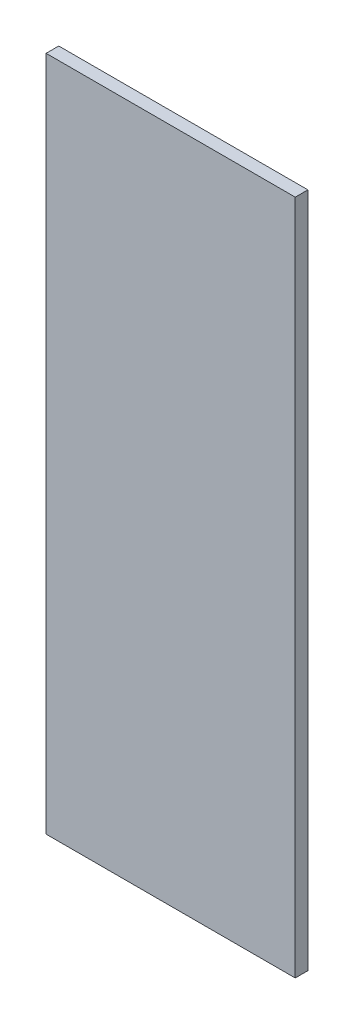
ISO-10303-21;
HEADER;
FILE_DESCRIPTION(('STEP AP214'),'2;1');
FILE_NAME('part.step','',(''),(''),'','','');
FILE_SCHEMA(('AUTOMOTIVE_DESIGN { 1 0 10303 214 1 1 1 1 }'));
ENDSEC;
DATA;
#1=APPLICATION_CONTEXT('core data for automotive mechanical design processes');
#2=APPLICATION_PROTOCOL_DEFINITION('international standard','automotive_design',2000,#1);
#3=PRODUCT_CONTEXT('',#1,'mechanical');
#4=PRODUCT('Part','Part','',(#3));
#5=PRODUCT_RELATED_PRODUCT_CATEGORY('part','',(#4));
#6=PRODUCT_DEFINITION_FORMATION('','',#4);
#7=PRODUCT_DEFINITION_CONTEXT('part definition',#1,'design');
#8=PRODUCT_DEFINITION('design','',#6,#7);
#9=PRODUCT_DEFINITION_SHAPE('','',#8);
#10=(LENGTH_UNIT() NAMED_UNIT(*) SI_UNIT(.MILLI.,.METRE.));
#11=(NAMED_UNIT(*) PLANE_ANGLE_UNIT() SI_UNIT($,.RADIAN.));
#12=(NAMED_UNIT(*) SI_UNIT($,.STERADIAN.) SOLID_ANGLE_UNIT());
#13=UNCERTAINTY_MEASURE_WITH_UNIT(LENGTH_MEASURE(1.E-05),#10,'distance_accuracy_value','');
#14=(GEOMETRIC_REPRESENTATION_CONTEXT(3) GLOBAL_UNCERTAINTY_ASSIGNED_CONTEXT((#13)) GLOBAL_UNIT_ASSIGNED_CONTEXT((#10,
#11,#12)) REPRESENTATION_CONTEXT('',''));
#15=CARTESIAN_POINT('',(0.,0.,0.));
#16=DIRECTION('',(0.,0.,1.));
#17=DIRECTION('',(1.,0.,0.));
#18=AXIS2_PLACEMENT_3D('',#15,#16,#17);
#19=CARTESIAN_POINT('',(85.4420013427734,76.5279998779297,0.));
#20=DIRECTION('',(1.,0.,0.));
#21=DIRECTION('',(0.,-1.,0.));
#22=AXIS2_PLACEMENT_3D('',#19,#20,#21);
#23=PLANE('',#22);
#24=DIRECTION('',(0.,-1.,0.));
#25=VECTOR('',#24,1.);
#26=CARTESIAN_POINT('',(85.4420013427734,76.5279998779297,0.03556));
#27=LINE('',#26,#25);
#28=CARTESIAN_POINT('',(85.4420013427734,76.5279998779297,0.03556));
#29=VERTEX_POINT('',#28);
#30=CARTESIAN_POINT('',(85.4420013427734,74.6279983520508,0.03556));
#31=VERTEX_POINT('',#30);
#32=EDGE_CURVE('E11',#29,#31,#27,.T.);
#33=ORIENTED_EDGE('',*,*,#32,.F.);
#34=DIRECTION('',(0.,0.,1.));
#35=VECTOR('',#34,1.);
#36=CARTESIAN_POINT('',(85.4420013427734,76.5279998779297,0.));
#37=LINE('',#36,#35);
#38=CARTESIAN_POINT('',(85.4420013427734,76.5279998779297,0.));
#39=VERTEX_POINT('',#38);
#40=EDGE_CURVE('E24',#39,#29,#37,.T.);
#41=ORIENTED_EDGE('',*,*,#40,.F.);
#42=DIRECTION('',(0.,-1.,0.));
#43=VECTOR('',#42,1.);
#44=CARTESIAN_POINT('',(85.4420013427734,76.5279998779297,0.));
#45=LINE('',#44,#43);
#46=CARTESIAN_POINT('',(85.4420013427734,74.6279983520508,0.));
#47=VERTEX_POINT('',#46);
#48=EDGE_CURVE('E75',#39,#47,#45,.T.);
#49=ORIENTED_EDGE('',*,*,#48,.T.);
#50=DIRECTION('',(0.,0.,1.));
#51=VECTOR('',#50,1.);
#52=CARTESIAN_POINT('',(85.4420013427734,74.6279983520508,0.));
#53=LINE('',#52,#51);
#54=EDGE_CURVE('E37',#47,#31,#53,.T.);
#55=ORIENTED_EDGE('',*,*,#54,.T.);
#56=EDGE_LOOP('',(#33,#41,#49,#55));
#57=FACE_BOUND('',#56,.T.);
#58=ADVANCED_FACE('F17',(#57),#23,.F.);
#59=CARTESIAN_POINT('',(85.4420013427734,74.6279983520508,0.));
#60=DIRECTION('',(0.,1.,0.));
#61=DIRECTION('',(1.,0.,0.));
#62=AXIS2_PLACEMENT_3D('',#59,#60,#61);
#63=PLANE('',#62);
#64=DIRECTION('',(1.,0.,0.));
#65=VECTOR('',#64,1.);
#66=CARTESIAN_POINT('',(85.4420013427734,74.6279983520508,0.03556));
#67=LINE('',#66,#65);
#68=CARTESIAN_POINT('',(86.1419982910156,74.6279983520508,0.03556));
#69=VERTEX_POINT('',#68);
#70=EDGE_CURVE('E83',#31,#69,#67,.T.);
#71=ORIENTED_EDGE('',*,*,#70,.F.);
#72=ORIENTED_EDGE('',*,*,#54,.F.);
#73=DIRECTION('',(1.,0.,0.));
#74=VECTOR('',#73,1.);
#75=CARTESIAN_POINT('',(85.4420013427734,74.6279983520508,0.));
#76=LINE('',#75,#74);
#77=CARTESIAN_POINT('',(86.1419982910156,74.6279983520508,0.));
#78=VERTEX_POINT('',#77);
#79=EDGE_CURVE('E81',#47,#78,#76,.T.);
#80=ORIENTED_EDGE('',*,*,#79,.T.);
#81=DIRECTION('',(0.,0.,1.));
#82=VECTOR('',#81,1.);
#83=CARTESIAN_POINT('',(86.1419982910156,74.6279983520508,0.));
#84=LINE('',#83,#82);
#85=EDGE_CURVE('E67',#78,#69,#84,.T.);
#86=ORIENTED_EDGE('',*,*,#85,.T.);
#87=EDGE_LOOP('',(#71,#72,#80,#86));
#88=FACE_BOUND('',#87,.T.);
#89=ADVANCED_FACE('F89',(#88),#63,.F.);
#90=CARTESIAN_POINT('',(86.1419982910156,74.6279983520508,0.));
#91=DIRECTION('',(-1.,0.,0.));
#92=DIRECTION('',(0.,1.,0.));
#93=AXIS2_PLACEMENT_3D('',#90,#91,#92);
#94=PLANE('',#93);
#95=DIRECTION('',(0.,1.,0.));
#96=VECTOR('',#95,1.);
#97=CARTESIAN_POINT('',(86.1419982910156,74.6279983520508,0.03556));
#98=LINE('',#97,#96);
#99=CARTESIAN_POINT('',(86.1419982910156,76.5279998779297,0.03556));
#100=VERTEX_POINT('',#99);
#101=EDGE_CURVE('E71',#69,#100,#98,.T.);
#102=ORIENTED_EDGE('',*,*,#101,.F.);
#103=ORIENTED_EDGE('',*,*,#85,.F.);
#104=DIRECTION('',(0.,1.,0.));
#105=VECTOR('',#104,1.);
#106=CARTESIAN_POINT('',(86.1419982910156,74.6279983520508,0.));
#107=LINE('',#106,#105);
#108=CARTESIAN_POINT('',(86.1419982910156,76.5279998779297,0.));
#109=VERTEX_POINT('',#108);
#110=EDGE_CURVE('E63',#78,#109,#107,.T.);
#111=ORIENTED_EDGE('',*,*,#110,.T.);
#112=DIRECTION('',(0.,0.,1.));
#113=VECTOR('',#112,1.);
#114=CARTESIAN_POINT('',(86.1419982910156,76.5279998779297,0.));
#115=LINE('',#114,#113);
#116=EDGE_CURVE('E53',#109,#100,#115,.T.);
#117=ORIENTED_EDGE('',*,*,#116,.T.);
#118=EDGE_LOOP('',(#102,#103,#111,#117));
#119=FACE_BOUND('',#118,.T.);
#120=ADVANCED_FACE('F66',(#119),#94,.F.);
#121=CARTESIAN_POINT('',(86.1419982910156,76.5279998779297,0.));
#122=DIRECTION('',(0.,-1.,0.));
#123=DIRECTION('',(-1.,0.,0.));
#124=AXIS2_PLACEMENT_3D('',#121,#122,#123);
#125=PLANE('',#124);
#126=DIRECTION('',(-1.,0.,0.));
#127=VECTOR('',#126,1.);
#128=CARTESIAN_POINT('',(86.1419982910156,76.5279998779297,0.03556));
#129=LINE('',#128,#127);
#130=EDGE_CURVE('E59',#100,#29,#129,.T.);
#131=ORIENTED_EDGE('',*,*,#130,.F.);
#132=ORIENTED_EDGE('',*,*,#116,.F.);
#133=DIRECTION('',(-1.,0.,0.));
#134=VECTOR('',#133,1.);
#135=CARTESIAN_POINT('',(86.1419982910156,76.5279998779297,0.));
#136=LINE('',#135,#134);
#137=EDGE_CURVE('E57',#109,#39,#136,.T.);
#138=ORIENTED_EDGE('',*,*,#137,.T.);
#139=ORIENTED_EDGE('',*,*,#40,.T.);
#140=EDGE_LOOP('',(#131,#132,#138,#139));
#141=FACE_BOUND('',#140,.T.);
#142=ADVANCED_FACE('F55',(#141),#125,.F.);
#143=CARTESIAN_POINT('',(85.4420013427734,76.5279998779297,0.));
#144=DIRECTION('',(0.,0.,-1.));
#145=DIRECTION('',(-1.,0.,0.));
#146=AXIS2_PLACEMENT_3D('',#143,#144,#145);
#147=PLANE('',#146);
#148=ORIENTED_EDGE('',*,*,#137,.F.);
#149=ORIENTED_EDGE('',*,*,#110,.F.);
#150=ORIENTED_EDGE('',*,*,#79,.F.);
#151=ORIENTED_EDGE('',*,*,#48,.F.);
#152=EDGE_LOOP('',(#148,#149,#150,#151));
#153=FACE_BOUND('',#152,.T.);
#154=ADVANCED_FACE('F74',(#153),#147,.T.);
#155=CARTESIAN_POINT('',(85.4420013427734,76.5279998779297,0.03556));
#156=DIRECTION('',(0.,0.,-1.));
#157=DIRECTION('',(-1.,0.,0.));
#158=AXIS2_PLACEMENT_3D('',#155,#156,#157);
#159=PLANE('',#158);
#160=ORIENTED_EDGE('',*,*,#32,.T.);
#161=ORIENTED_EDGE('',*,*,#70,.T.);
#162=ORIENTED_EDGE('',*,*,#101,.T.);
#163=ORIENTED_EDGE('',*,*,#130,.T.);
#164=EDGE_LOOP('',(#160,#161,#162,#163));
#165=FACE_BOUND('',#164,.T.);
#166=ADVANCED_FACE('F91',(#165),#159,.F.);
#167=CLOSED_SHELL('',(#58,#89,#120,#142,#154,#166));
#168=MANIFOLD_SOLID_BREP('B1',#167);
#169=ADVANCED_BREP_SHAPE_REPRESENTATION('',(#18,#168),#14);
#170=SHAPE_DEFINITION_REPRESENTATION(#9,#169);
ENDSEC;
END-ISO-10303-21;
